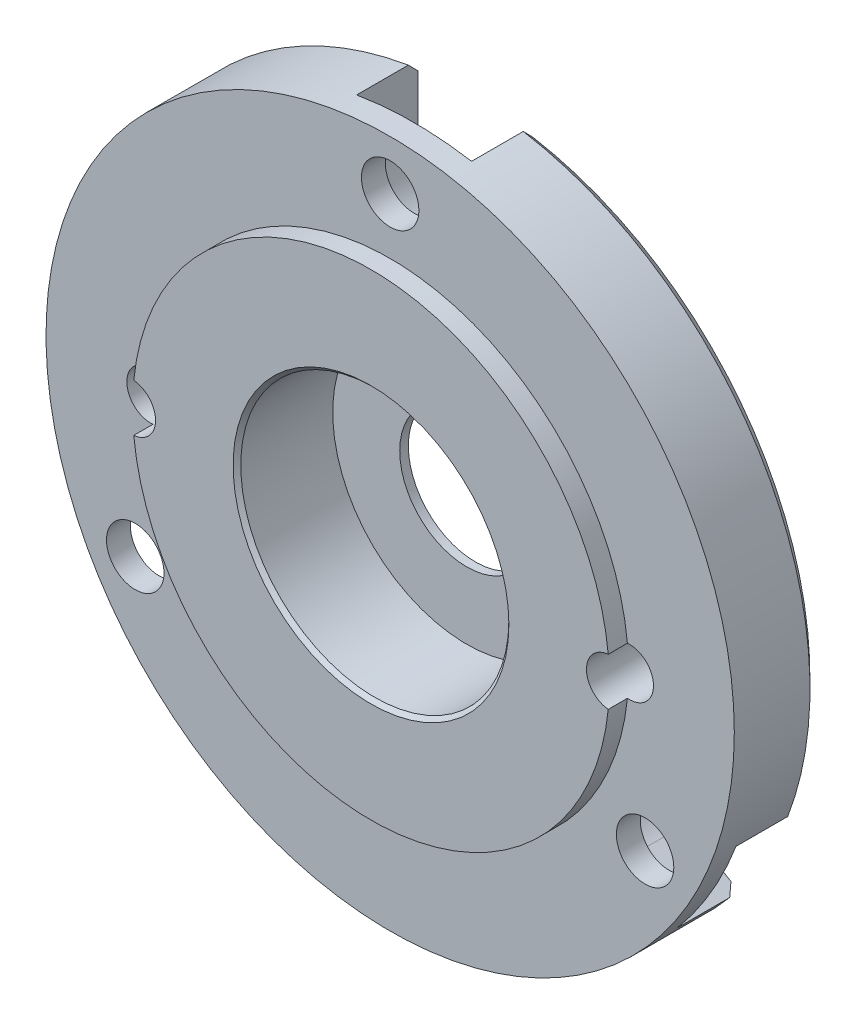
ISO-10303-21;
HEADER;
FILE_DESCRIPTION(('STEP AP214'),'2;1');
FILE_NAME('part.step','',(''),(''),'','','');
FILE_SCHEMA(('AUTOMOTIVE_DESIGN { 1 0 10303 214 1 1 1 1 }'));
ENDSEC;
DATA;
#1=APPLICATION_CONTEXT('core data for automotive mechanical design processes');
#2=APPLICATION_PROTOCOL_DEFINITION('international standard','automotive_design',2000,#1);
#3=PRODUCT_CONTEXT('',#1,'mechanical');
#4=PRODUCT('Part','Part','',(#3));
#5=PRODUCT_RELATED_PRODUCT_CATEGORY('part','',(#4));
#6=PRODUCT_DEFINITION_FORMATION('','',#4);
#7=PRODUCT_DEFINITION_CONTEXT('part definition',#1,'design');
#8=PRODUCT_DEFINITION('design','',#6,#7);
#9=PRODUCT_DEFINITION_SHAPE('','',#8);
#10=(LENGTH_UNIT() NAMED_UNIT(*) SI_UNIT(.MILLI.,.METRE.));
#11=(NAMED_UNIT(*) PLANE_ANGLE_UNIT() SI_UNIT($,.RADIAN.));
#12=(NAMED_UNIT(*) SI_UNIT($,.STERADIAN.) SOLID_ANGLE_UNIT());
#13=UNCERTAINTY_MEASURE_WITH_UNIT(LENGTH_MEASURE(1.E-05),#10,'distance_accuracy_value','');
#14=(GEOMETRIC_REPRESENTATION_CONTEXT(3) GLOBAL_UNCERTAINTY_ASSIGNED_CONTEXT((#13)) GLOBAL_UNIT_ASSIGNED_CONTEXT((#10,
#11,#12)) REPRESENTATION_CONTEXT('',''));
#15=CARTESIAN_POINT('',(0.,0.,0.));
#16=DIRECTION('',(0.,0.,1.));
#17=DIRECTION('',(1.,0.,0.));
#18=AXIS2_PLACEMENT_3D('',#15,#16,#17);
#19=CARTESIAN_POINT('',(-74.8422031977456,51.8720779220779,5.45));
#20=DIRECTION('',(0.,0.,-1.));
#21=DIRECTION('',(-1.,0.,0.));
#22=AXIS2_PLACEMENT_3D('',#19,#20,#21);
#23=CYLINDRICAL_SURFACE('',#22,12.45);
#24=CARTESIAN_POINT('',(-74.8422031977456,51.8720779220779,4.45));
#25=DIRECTION('',(0.,0.,1.));
#26=DIRECTION('',(1.,0.,0.));
#27=AXIS2_PLACEMENT_3D('',#24,#25,#26);
#28=CIRCLE('',#27,12.45);
#29=CARTESIAN_POINT('',(-62.4546031977456,53.1170141614091,4.45));
#30=VERTEX_POINT('',#29);
#31=CARTESIAN_POINT('',(-87.2298031977457,53.1170141614091,4.45));
#32=VERTEX_POINT('',#31);
#33=EDGE_CURVE('E175',#30,#32,#28,.T.);
#34=ORIENTED_EDGE('',*,*,#33,.T.);
#35=DIRECTION('',(0.,0.,-1.));
#36=VECTOR('',#35,1.);
#37=CARTESIAN_POINT('',(-87.2298031977457,53.1170141614091,2.725));
#38=LINE('',#37,#36);
#39=CARTESIAN_POINT('',(-87.2298031977457,53.1170141614091,5.45));
#40=VERTEX_POINT('',#39);
#41=EDGE_CURVE('E163',#32,#40,#38,.F.);
#42=ORIENTED_EDGE('',*,*,#41,.T.);
#43=CARTESIAN_POINT('',(-74.8422031977456,51.8720779220779,5.45));
#44=DIRECTION('',(0.,0.,1.));
#45=DIRECTION('',(1.,0.,0.));
#46=AXIS2_PLACEMENT_3D('',#43,#44,#45);
#47=CIRCLE('',#46,12.45);
#48=CARTESIAN_POINT('',(-62.4546031977456,53.117014161409,5.45));
#49=VERTEX_POINT('',#48);
#50=EDGE_CURVE('E173',#49,#40,#47,.T.);
#51=ORIENTED_EDGE('',*,*,#50,.F.);
#52=DIRECTION('',(0.,0.,-1.));
#53=VECTOR('',#52,1.);
#54=CARTESIAN_POINT('',(-62.4546031977456,53.1170141614091,2.725));
#55=LINE('',#54,#53);
#56=EDGE_CURVE('E54',#49,#30,#55,.T.);
#57=ORIENTED_EDGE('',*,*,#56,.T.);
#58=EDGE_LOOP('',(#34,#42,#51,#57));
#59=FACE_BOUND('',#58,.T.);
#60=ADVANCED_FACE('F32',(#59),#23,.T.);
#61=CARTESIAN_POINT('',(-74.8422031977456,51.8720779220779,0.500000000000004));
#62=DIRECTION('',(0.,0.,1.));
#63=DIRECTION('',(1.,0.,0.));
#64=AXIS2_PLACEMENT_3D('',#61,#62,#63);
#65=CONICAL_SURFACE('',#64,17.97,0.785398163397448);
#66=CARTESIAN_POINT('',(-88.2002208778621,40.6134245524384,-0.000199999999997867));
#67=CARTESIAN_POINT('',(-88.2735733593311,40.5710744775165,0.0831814825688447));
#68=CARTESIAN_POINT('',(-88.3469179438918,40.5287289618768,0.166572223860307));
#69=CARTESIAN_POINT('',(-88.4935913191717,40.444047049176,0.333372223860313));
#70=CARTESIAN_POINT('',(-88.566920109891,40.4017106521149,0.416781482568851));
#71=CARTESIAN_POINT('',(-88.6402410037019,40.359378814336,0.500200000000002));
#72=B_SPLINE_CURVE_WITH_KNOTS('',3,(#66,#67,#68,#69,#70,#71),.UNSPECIFIED.,.F.,.F.,(4,2,4),(0.,
0.356565952680265,0.713131905240145),.UNSPECIFIED.);
#73=CARTESIAN_POINT('',(-88.2003968232458,40.6133229703238,0.));
#74=VERTEX_POINT('',#73);
#75=CARTESIAN_POINT('',(-88.6400652121353,40.3594803076443,0.500000000000008));
#76=VERTEX_POINT('',#75);
#77=EDGE_CURVE('E303',#74,#76,#72,.T.);
#78=ORIENTED_EDGE('',*,*,#77,.F.);
#79=CARTESIAN_POINT('',(-74.8422031977456,51.8720779220779,0.));
#80=DIRECTION('',(0.,0.,1.));
#81=DIRECTION('',(1.,0.,0.));
#82=AXIS2_PLACEMENT_3D('',#79,#80,#81);
#83=CIRCLE('',#82,17.47);
#84=CARTESIAN_POINT('',(-61.4977207946703,40.5970750664679,0.));
#85=VERTEX_POINT('',#84);
#86=EDGE_CURVE('E202',#85,#74,#83,.F.);
#87=ORIENTED_EDGE('',*,*,#86,.F.);
#88=CARTESIAN_POINT('',(-61.0635427554935,40.3361945810799,0.500200000000005));
#89=CARTESIAN_POINT('',(-61.1359218595241,40.3796843343324,0.416784823088143));
#90=CARTESIAN_POINT('',(-61.2083073868908,40.4231779471146,0.333377234636964));
#91=CARTESIAN_POINT('',(-61.3530912883131,40.5101728917485,0.166577234636959));
#92=CARTESIAN_POINT('',(-61.4254896623686,40.5536742236001,0.0831848230881354));
#93=CARTESIAN_POINT('',(-61.4978944597603,40.5971794149814,-0.000200000000000809));
#94=B_SPLINE_CURVE_WITH_KNOTS('',3,(#88,#89,#90,#91,#92,#93),.UNSPECIFIED.,.F.,.F.,(4,2,4),(0.,
0.356080977624851,0.712161955330887),.UNSPECIFIED.);
#95=CARTESIAN_POINT('',(-61.0637162958092,40.3362988546215,0.500000000000004));
#96=VERTEX_POINT('',#95);
#97=EDGE_CURVE('E433',#96,#85,#94,.T.);
#98=ORIENTED_EDGE('',*,*,#97,.F.);
#99=CARTESIAN_POINT('',(-74.8422031977456,51.8720779220779,0.500000000000004));
#100=DIRECTION('',(0.,0.,1.));
#101=DIRECTION('',(1.,0.,0.));
#102=AXIS2_PLACEMENT_3D('',#99,#100,#101);
#103=CIRCLE('',#102,17.97);
#104=EDGE_CURVE('E197',#76,#96,#103,.T.);
#105=ORIENTED_EDGE('',*,*,#104,.F.);
#106=EDGE_LOOP('',(#78,#87,#98,#105));
#107=FACE_BOUND('',#106,.T.);
#108=ADVANCED_FACE('F254',(#107),#65,.T.);
#109=CARTESIAN_POINT('',(-88.1530136539125,44.1870779220779,5.45));
#110=DIRECTION('',(0.,0.,-1.));
#111=DIRECTION('',(-1.,0.,0.));
#112=AXIS2_PLACEMENT_3D('',#109,#110,#111);
#113=CYLINDRICAL_SURFACE('',#112,1.50000000000001);
#114=CARTESIAN_POINT('',(-88.1530136539125,44.1870779220779,4.45));
#115=DIRECTION('',(0.,0.,1.));
#116=DIRECTION('',(1.,0.,0.));
#117=AXIS2_PLACEMENT_3D('',#114,#115,#116);
#118=CIRCLE('',#117,1.50000000000001);
#119=CARTESIAN_POINT('',(-86.6530136539124,44.1870779220779,4.45));
#120=VERTEX_POINT('',#119);
#121=EDGE_CURVE('E324',#120,#120,#118,.T.);
#122=ORIENTED_EDGE('',*,*,#121,.T.);
#123=EDGE_LOOP('',(#122));
#124=FACE_BOUND('',#123,.T.);
#125=CARTESIAN_POINT('',(-88.1530136539125,44.1870779220779,3.2));
#126=DIRECTION('',(0.,0.,-1.));
#127=DIRECTION('',(-1.,0.,0.));
#128=AXIS2_PLACEMENT_3D('',#125,#126,#127);
#129=CIRCLE('',#128,1.50000000000001);
#130=CARTESIAN_POINT('',(-89.6530136539125,44.1870779220779,3.2));
#131=VERTEX_POINT('',#130);
#132=EDGE_CURVE('E362',#131,#131,#129,.F.);
#133=ORIENTED_EDGE('',*,*,#132,.F.);
#134=EDGE_LOOP('',(#133));
#135=FACE_BOUND('',#134,.T.);
#136=ADVANCED_FACE('F250',(#124,#135),#113,.F.);
#137=CARTESIAN_POINT('',(-58.4699334263535,45.7775972573485,-0.000199999999999618));
#138=CARTESIAN_POINT('',(-58.3972269334165,45.7339107889951,0.083179707136008));
#139=CARTESIAN_POINT('',(-58.3245289939025,45.6902294600567,0.166569560712443));
#140=CARTESIAN_POINT('',(-58.1791502217499,45.6028770810276,0.333369560712453));
#141=CARTESIAN_POINT('',(-58.1064693891112,45.5592060309369,0.416779707136019));
#142=CARTESIAN_POINT('',(-58.0337971098956,45.5155401202612,0.500200000000005));
#143=B_SPLINE_CURVE_WITH_KNOTS('',3,(#137,#138,#139,#140,#141,#142),.UNSPECIFIED.,.F.,.F.,(4,2,
4),(0.,0.35682243382694,0.713644867509625),.UNSPECIFIED.);
#144=CARTESIAN_POINT('',(-58.4697590266398,45.7774924674286,0.));
#145=VERTEX_POINT('',#144);
#146=CARTESIAN_POINT('',(-58.0339713427646,45.5156448099307,0.500000000000008));
#147=VERTEX_POINT('',#146);
#148=EDGE_CURVE('E304',#145,#147,#143,.T.);
#149=ORIENTED_EDGE('',*,*,#148,.F.);
#150=CARTESIAN_POINT('',(-71.8422031977456,69.0825660034776,0.));
#151=VERTEX_POINT('',#150);
#152=EDGE_CURVE('E198',#151,#145,#83,.F.);
#153=ORIENTED_EDGE('',*,*,#152,.F.);
#154=CARTESIAN_POINT('',(-71.8422031977456,73.9510229847034,4.81182701392405));
#155=CARTESIAN_POINT('',(-71.8422031977456,73.188762335671,4.05656477941625));
#156=CARTESIAN_POINT('',(-71.8422031977456,72.4262004104416,3.30160534713981));
#157=CARTESIAN_POINT('',(-71.8422031977456,70.9000867576194,1.79269394851582));
#158=CARTESIAN_POINT('',(-71.8422031977456,70.1365350340635,1.0387419780846));
#159=CARTESIAN_POINT('',(-71.8422031977456,68.9901688084127,-0.0911347826652783));
#160=CARTESIAN_POINT('',(-71.8422031977456,68.6078730218659,-0.467585764161266));
#161=CARTESIAN_POINT('',(-71.8422031977456,67.8428519948834,-1.22005090566893));
#162=CARTESIAN_POINT('',(-71.8422031977456,67.4601267545847,-1.59606506581993));
#163=CARTESIAN_POINT('',(-71.8422031977456,66.6941483008052,-2.34755852838192));
#164=CARTESIAN_POINT('',(-71.8422031977456,66.3108950851956,-2.72303782862397));
#165=CARTESIAN_POINT('',(-71.8422031977456,65.5437149731561,-3.4733083304253));
#166=CARTESIAN_POINT('',(-71.8422031977456,65.1597880759751,-3.8480995312165));
#167=CARTESIAN_POINT('',(-71.8422031977456,64.7754511392664,-4.22247040456009));
#168=B_SPLINE_CURVE_WITH_KNOTS('',3,(#154,#155,#156,#157,#158,#159,#160,#161,#162,#163,#164,
#165,#166,#167),.UNSPECIFIED.,.F.,.F.,(4,2,2,2,2,2,4),(0.,3.21918774994048,6.43836241132598,
8.04795482634141,9.65754672784897,11.2671451379849,12.8767453436743),.UNSPECIFIED.);
#169=CARTESIAN_POINT('',(-71.8422031977456,69.5898909925446,0.500000000000004));
#170=VERTEX_POINT('',#169);
#171=EDGE_CURVE('E201',#170,#151,#168,.T.);
#172=ORIENTED_EDGE('',*,*,#171,.F.);
#173=EDGE_CURVE('E185',#147,#170,#103,.T.);
#174=ORIENTED_EDGE('',*,*,#173,.F.);
#175=EDGE_LOOP('',(#149,#153,#172,#174));
#176=FACE_BOUND('',#175,.T.);
#177=ADVANCED_FACE('F253',(#176),#65,.T.);
#178=CARTESIAN_POINT('',(-61.5313927415788,44.187077922078,5.45));
#179=DIRECTION('',(0.,0.,-1.));
#180=DIRECTION('',(-1.,0.,0.));
#181=AXIS2_PLACEMENT_3D('',#178,#179,#180);
#182=CYLINDRICAL_SURFACE('',#181,1.5);
#183=CARTESIAN_POINT('',(-61.5313927415788,44.187077922078,4.45));
#184=DIRECTION('',(0.,0.,1.));
#185=DIRECTION('',(1.,0.,0.));
#186=AXIS2_PLACEMENT_3D('',#183,#184,#185);
#187=CIRCLE('',#186,1.5);
#188=CARTESIAN_POINT('',(-60.0313927415788,44.187077922078,4.45));
#189=VERTEX_POINT('',#188);
#190=EDGE_CURVE('E326',#189,#189,#187,.T.);
#191=ORIENTED_EDGE('',*,*,#190,.T.);
#192=EDGE_LOOP('',(#191));
#193=FACE_BOUND('',#192,.T.);
#194=CARTESIAN_POINT('',(-61.5313927415788,44.187077922078,3.2));
#195=DIRECTION('',(0.,0.,-1.));
#196=DIRECTION('',(-1.,0.,0.));
#197=AXIS2_PLACEMENT_3D('',#194,#195,#196);
#198=CIRCLE('',#197,1.5);
#199=CARTESIAN_POINT('',(-63.0313927415788,44.187077922078,3.2));
#200=VERTEX_POINT('',#199);
#201=EDGE_CURVE('E389',#200,#200,#198,.F.);
#202=ORIENTED_EDGE('',*,*,#201,.F.);
#203=EDGE_LOOP('',(#202));
#204=FACE_BOUND('',#203,.T.);
#205=ADVANCED_FACE('F256',(#193,#204),#182,.F.);
#206=CARTESIAN_POINT('',(-74.8422031977456,67.2420779220779,5.45));
#207=DIRECTION('',(0.,0.,-1.));
#208=DIRECTION('',(-1.,0.,0.));
#209=AXIS2_PLACEMENT_3D('',#206,#207,#208);
#210=CYLINDRICAL_SURFACE('',#209,1.5);
#211=CARTESIAN_POINT('',(-74.8422031977456,67.2420779220779,4.45));
#212=DIRECTION('',(0.,0.,1.));
#213=DIRECTION('',(1.,0.,0.));
#214=AXIS2_PLACEMENT_3D('',#211,#212,#213);
#215=CIRCLE('',#214,1.5);
#216=CARTESIAN_POINT('',(-73.3422031977456,67.2420779220779,4.45));
#217=VERTEX_POINT('',#216);
#218=EDGE_CURVE('E189',#217,#217,#215,.T.);
#219=ORIENTED_EDGE('',*,*,#218,.T.);
#220=EDGE_LOOP('',(#219));
#221=FACE_BOUND('',#220,.T.);
#222=CARTESIAN_POINT('',(-74.8422031977456,67.2420779220779,3.2));
#223=DIRECTION('',(0.,0.,-1.));
#224=DIRECTION('',(-1.,0.,0.));
#225=AXIS2_PLACEMENT_3D('',#222,#223,#224);
#226=CIRCLE('',#225,1.5);
#227=CARTESIAN_POINT('',(-76.3422031977456,67.2420779220779,3.2));
#228=VERTEX_POINT('',#227);
#229=EDGE_CURVE('E208',#228,#228,#226,.F.);
#230=ORIENTED_EDGE('',*,*,#229,.F.);
#231=EDGE_LOOP('',(#230));
#232=FACE_BOUND('',#231,.T.);
#233=ADVANCED_FACE('F248',(#221,#232),#210,.F.);
#234=CARTESIAN_POINT('',(-74.8422031977456,51.8720779220779,5.45));
#235=DIRECTION('',(0.,0.,-1.));
#236=DIRECTION('',(-1.,0.,0.));
#237=AXIS2_PLACEMENT_3D('',#234,#235,#236);
#238=CYLINDRICAL_SURFACE('',#237,3.50000000000001);
#239=CARTESIAN_POINT('',(-74.8422031977456,51.8720779220779,0.));
#240=DIRECTION('',(0.,0.,-1.));
#241=DIRECTION('',(-1.,0.,0.));
#242=AXIS2_PLACEMENT_3D('',#239,#240,#241);
#243=CIRCLE('',#242,3.50000000000001);
#244=CARTESIAN_POINT('',(-78.3422031977456,51.8720779220779,0.));
#245=VERTEX_POINT('',#244);
#246=EDGE_CURVE('E206',#245,#245,#243,.T.);
#247=ORIENTED_EDGE('',*,*,#246,.T.);
#248=EDGE_LOOP('',(#247));
#249=FACE_BOUND('',#248,.T.);
#250=CARTESIAN_POINT('',(-74.8422031977456,51.8720779220779,0.45));
#251=DIRECTION('',(0.,0.,1.));
#252=DIRECTION('',(1.,0.,0.));
#253=AXIS2_PLACEMENT_3D('',#250,#251,#252);
#254=CIRCLE('',#253,3.50000000000001);
#255=CARTESIAN_POINT('',(-71.3422031977456,51.8720779220779,0.45));
#256=VERTEX_POINT('',#255);
#257=EDGE_CURVE('E203',#256,#256,#254,.F.);
#258=ORIENTED_EDGE('',*,*,#257,.F.);
#259=EDGE_LOOP('',(#258));
#260=FACE_BOUND('',#259,.T.);
#261=ADVANCED_FACE('F244',(#249,#260),#238,.F.);
#262=CARTESIAN_POINT('',(-74.8422031977456,51.8720779220779,4.45));
#263=DIRECTION('',(0.,0.,1.));
#264=DIRECTION('',(1.,0.,0.));
#265=AXIS2_PLACEMENT_3D('',#262,#263,#264);
#266=PLANE('',#265);
#267=CARTESIAN_POINT('',(-87.3422031977456,51.8720779220779,4.45));
#268=DIRECTION('',(0.,0.,1.));
#269=DIRECTION('',(1.,0.,0.));
#270=AXIS2_PLACEMENT_3D('',#267,#268,#269);
#271=CIRCLE('',#270,1.25);
#272=CARTESIAN_POINT('',(-87.2298031977457,50.6271416827468,4.45));
#273=VERTEX_POINT('',#272);
#274=EDGE_CURVE('E177',#32,#273,#271,.T.);
#275=ORIENTED_EDGE('',*,*,#274,.F.);
#276=ORIENTED_EDGE('',*,*,#33,.F.);
#277=CARTESIAN_POINT('',(-62.3422031977456,51.8720779220779,4.45));
#278=DIRECTION('',(0.,0.,1.));
#279=DIRECTION('',(1.,0.,0.));
#280=AXIS2_PLACEMENT_3D('',#277,#278,#279);
#281=CIRCLE('',#280,1.24999999999998);
#282=CARTESIAN_POINT('',(-62.4546031977456,50.6271416827468,4.45));
#283=VERTEX_POINT('',#282);
#284=EDGE_CURVE('E337',#283,#30,#281,.T.);
#285=ORIENTED_EDGE('',*,*,#284,.F.);
#286=EDGE_CURVE('E191',#273,#283,#28,.T.);
#287=ORIENTED_EDGE('',*,*,#286,.F.);
#288=EDGE_LOOP('',(#275,#276,#285,#287));
#289=FACE_BOUND('',#288,.T.);
#290=ORIENTED_EDGE('',*,*,#121,.F.);
#291=EDGE_LOOP('',(#290));
#292=FACE_BOUND('',#291,.T.);
#293=ORIENTED_EDGE('',*,*,#190,.F.);
#294=EDGE_LOOP('',(#293));
#295=FACE_BOUND('',#294,.T.);
#296=ORIENTED_EDGE('',*,*,#218,.F.);
#297=EDGE_LOOP('',(#296));
#298=FACE_BOUND('',#297,.T.);
#299=CARTESIAN_POINT('',(-74.8422031977456,51.8720779220779,4.45));
#300=DIRECTION('',(0.,0.,1.));
#301=DIRECTION('',(1.,0.,0.));
#302=AXIS2_PLACEMENT_3D('',#299,#300,#301);
#303=CIRCLE('',#302,17.97);
#304=CARTESIAN_POINT('',(-56.8722031977456,51.8720779220779,4.45));
#305=VERTEX_POINT('',#304);
#306=EDGE_CURVE('E181',#305,#305,#303,.T.);
#307=ORIENTED_EDGE('',*,*,#306,.T.);
#308=EDGE_LOOP('',(#307));
#309=FACE_BOUND('',#308,.T.);
#310=ADVANCED_FACE('F247',(#289,#292,#295,#298,#309),#266,.T.);
#311=CARTESIAN_POINT('',(-74.8422031977456,51.8720779220779,4.45));
#312=DIRECTION('',(0.,0.,-1.));
#313=DIRECTION('',(-1.,0.,0.));
#314=AXIS2_PLACEMENT_3D('',#311,#312,#313);
#315=CYLINDRICAL_SURFACE('',#314,17.97);
#316=CARTESIAN_POINT('',(-74.8422031977456,51.8720779220779,3.2));
#317=DIRECTION('',(0.,0.,-1.));
#318=DIRECTION('',(-1.,0.,0.));
#319=AXIS2_PLACEMENT_3D('',#316,#317,#318);
#320=CIRCLE('',#319,17.97);
#321=CARTESIAN_POINT('',(-88.6400652121353,40.3594803076443,3.2));
#322=VERTEX_POINT('',#321);
#323=CARTESIAN_POINT('',(-91.6609672281103,45.5435649458005,3.2));
#324=VERTEX_POINT('',#323);
#325=EDGE_CURVE('E365',#322,#324,#320,.T.);
#326=ORIENTED_EDGE('',*,*,#325,.F.);
#327=DIRECTION('',(0.,0.,-1.));
#328=VECTOR('',#327,1.);
#329=CARTESIAN_POINT('',(-88.6400652121353,40.3594803076443,4.45));
#330=LINE('',#329,#328);
#331=EDGE_CURVE('E368',#322,#76,#330,.T.);
#332=ORIENTED_EDGE('',*,*,#331,.T.);
#333=ORIENTED_EDGE('',*,*,#104,.T.);
#334=DIRECTION('',(0.,0.,-1.));
#335=VECTOR('',#334,1.);
#336=CARTESIAN_POINT('',(-61.0637162958092,40.3362988546215,4.45));
#337=LINE('',#336,#335);
#338=CARTESIAN_POINT('',(-61.0637162958092,40.3362988546215,3.2));
#339=VERTEX_POINT('',#338);
#340=EDGE_CURVE('E394',#96,#339,#337,.F.);
#341=ORIENTED_EDGE('',*,*,#340,.T.);
#342=CARTESIAN_POINT('',(-74.8422031977456,51.8720779220779,3.2));
#343=DIRECTION('',(0.,0.,-1.));
#344=DIRECTION('',(-1.,0.,0.));
#345=AXIS2_PLACEMENT_3D('',#342,#343,#344);
#346=CIRCLE('',#345,17.97);
#347=CARTESIAN_POINT('',(-58.0339713427646,45.5156448099307,3.2));
#348=VERTEX_POINT('',#347);
#349=EDGE_CURVE('E392',#348,#339,#346,.T.);
#350=ORIENTED_EDGE('',*,*,#349,.F.);
#351=DIRECTION('',(0.,0.,-1.));
#352=VECTOR('',#351,1.);
#353=CARTESIAN_POINT('',(-58.0339713427646,45.5156448099307,4.45));
#354=LINE('',#353,#352);
#355=EDGE_CURVE('E397',#348,#147,#354,.T.);
#356=ORIENTED_EDGE('',*,*,#355,.T.);
#357=ORIENTED_EDGE('',*,*,#173,.T.);
#358=DIRECTION('',(0.,0.,-1.));
#359=VECTOR('',#358,1.);
#360=CARTESIAN_POINT('',(-71.8422031977456,69.5898909925446,4.45));
#361=LINE('',#360,#359);
#362=CARTESIAN_POINT('',(-71.8422031977456,69.5898909925446,3.2));
#363=VERTEX_POINT('',#362);
#364=EDGE_CURVE('E315',#170,#363,#361,.F.);
#365=ORIENTED_EDGE('',*,*,#364,.T.);
#366=CARTESIAN_POINT('',(-74.8422031977456,51.8720779220779,3.2));
#367=DIRECTION('',(0.,0.,-1.));
#368=DIRECTION('',(-1.,0.,0.));
#369=AXIS2_PLACEMENT_3D('',#366,#367,#368);
#370=CIRCLE('',#369,17.97);
#371=CARTESIAN_POINT('',(-77.8422031977456,69.5898909925446,3.2));
#372=VERTEX_POINT('',#371);
#373=EDGE_CURVE('E211',#372,#363,#370,.T.);
#374=ORIENTED_EDGE('',*,*,#373,.F.);
#375=DIRECTION('',(0.,0.,-1.));
#376=VECTOR('',#375,1.);
#377=CARTESIAN_POINT('',(-77.8422031977456,69.5898909925446,4.45));
#378=LINE('',#377,#376);
#379=CARTESIAN_POINT('',(-77.8422031977456,69.5898909925446,0.500000000000008));
#380=VERTEX_POINT('',#379);
#381=EDGE_CURVE('E310',#372,#380,#378,.T.);
#382=ORIENTED_EDGE('',*,*,#381,.T.);
#383=CARTESIAN_POINT('',(-91.6609672281103,45.5435649458005,0.500000000000004));
#384=VERTEX_POINT('',#383);
#385=EDGE_CURVE('E193',#380,#384,#103,.T.);
#386=ORIENTED_EDGE('',*,*,#385,.T.);
#387=DIRECTION('',(0.,0.,-1.));
#388=VECTOR('',#387,1.);
#389=CARTESIAN_POINT('',(-91.6609672281103,45.5435649458005,4.45));
#390=LINE('',#389,#388);
#391=EDGE_CURVE('E308',#384,#324,#390,.F.);
#392=ORIENTED_EDGE('',*,*,#391,.T.);
#393=EDGE_LOOP('',(#326,#332,#333,#341,#350,#356,#357,#365,#374,#382,#386,#392));
#394=FACE_BOUND('',#393,.T.);
#395=ORIENTED_EDGE('',*,*,#306,.F.);
#396=EDGE_LOOP('',(#395));
#397=FACE_BOUND('',#396,.T.);
#398=ADVANCED_FACE('F272',(#394,#397),#315,.T.);
#399=CARTESIAN_POINT('',(-74.8422031977456,51.8720779220779,0.));
#400=DIRECTION('',(0.,0.,1.));
#401=DIRECTION('',(1.,0.,0.));
#402=AXIS2_PLACEMENT_3D('',#399,#400,#401);
#403=PLANE('',#402);
#404=CARTESIAN_POINT('',(-87.3422031977456,51.8720779220779,0.));
#405=DIRECTION('',(0.,0.,-1.));
#406=DIRECTION('',(-1.,0.,0.));
#407=AXIS2_PLACEMENT_3D('',#404,#405,#406);
#408=CIRCLE('',#407,1.25);
#409=CARTESIAN_POINT('',(-88.5922031977456,51.8720779220779,0.));
#410=VERTEX_POINT('',#409);
#411=EDGE_CURVE('E168',#410,#410,#408,.T.);
#412=ORIENTED_EDGE('',*,*,#411,.F.);
#413=EDGE_LOOP('',(#412));
#414=FACE_BOUND('',#413,.T.);
#415=CARTESIAN_POINT('',(-62.3422031977456,51.8720779220779,0.));
#416=DIRECTION('',(0.,0.,-1.));
#417=DIRECTION('',(-1.,0.,0.));
#418=AXIS2_PLACEMENT_3D('',#415,#416,#417);
#419=CIRCLE('',#418,1.24999999999998);
#420=CARTESIAN_POINT('',(-63.5922031977456,51.8720779220779,0.));
#421=VERTEX_POINT('',#420);
#422=EDGE_CURVE('E176',#421,#421,#419,.T.);
#423=ORIENTED_EDGE('',*,*,#422,.F.);
#424=EDGE_LOOP('',(#423));
#425=FACE_BOUND('',#424,.T.);
#426=ORIENTED_EDGE('',*,*,#246,.F.);
#427=EDGE_LOOP('',(#426));
#428=FACE_BOUND('',#427,.T.);
#429=ORIENTED_EDGE('',*,*,#86,.T.);
#430=DIRECTION('',(-0.86602540378444,-0.499999999999998,0.));
#431=VECTOR('',#430,1.);
#432=CARTESIAN_POINT('',(-89.3713389427206,39.9372792224396,0.));
#433=LINE('',#432,#431);
#434=CARTESIAN_POINT('',(-85.8654510915531,41.9614045170597,0.));
#435=VERTEX_POINT('',#434);
#436=EDGE_CURVE('E348',#435,#74,#433,.T.);
#437=ORIENTED_EDGE('',*,*,#436,.F.);
#438=CARTESIAN_POINT('',(-87.365451091553,44.5594807284128,0.));
#439=DIRECTION('',(0.,0.,-1.));
#440=DIRECTION('',(-1.,0.,0.));
#441=AXIS2_PLACEMENT_3D('',#438,#439,#440);
#442=CIRCLE('',#441,2.99999999999972);
#443=CARTESIAN_POINT('',(-88.8654510915528,47.1575569397659,0.));
#444=VERTEX_POINT('',#443);
#445=EDGE_CURVE('E356',#444,#435,#442,.T.);
#446=ORIENTED_EDGE('',*,*,#445,.F.);
#447=DIRECTION('',(0.866025403784438,0.5,0.));
#448=VECTOR('',#447,1.);
#449=CARTESIAN_POINT('',(-92.3713389427203,45.1334316451457,0.));
#450=LINE('',#449,#448);
#451=CARTESIAN_POINT('',(-91.2219149928599,45.7970518720106,0.));
#452=VERTEX_POINT('',#451);
#453=EDGE_CURVE('E338',#452,#444,#450,.T.);
#454=ORIENTED_EDGE('',*,*,#453,.F.);
#455=CARTESIAN_POINT('',(-77.8422031977456,69.0825660034776,0.));
#456=VERTEX_POINT('',#455);
#457=EDGE_CURVE('E196',#452,#456,#83,.F.);
#458=ORIENTED_EDGE('',*,*,#457,.T.);
#459=DIRECTION('',(0.,1.,0.));
#460=VECTOR('',#459,1.);
#461=CARTESIAN_POINT('',(-77.8422031977456,70.4119051335084,0.));
#462=LINE('',#461,#460);
#463=CARTESIAN_POINT('',(-77.8422031977456,66.3636545442682,0.));
#464=VERTEX_POINT('',#463);
#465=EDGE_CURVE('E404',#464,#456,#462,.T.);
#466=ORIENTED_EDGE('',*,*,#465,.F.);
#467=CARTESIAN_POINT('',(-74.8422031977456,66.3636545442682,0.));
#468=DIRECTION('',(0.,0.,-1.));
#469=DIRECTION('',(-1.,0.,0.));
#470=AXIS2_PLACEMENT_3D('',#467,#468,#469);
#471=CIRCLE('',#470,3.);
#472=CARTESIAN_POINT('',(-71.8422031977456,66.3636545442682,0.));
#473=VERTEX_POINT('',#472);
#474=EDGE_CURVE('E411',#473,#464,#471,.T.);
#475=ORIENTED_EDGE('',*,*,#474,.F.);
#476=DIRECTION('',(0.,-1.,0.));
#477=VECTOR('',#476,1.);
#478=CARTESIAN_POINT('',(-71.8422031977456,70.4119051335084,0.));
#479=LINE('',#478,#477);
#480=EDGE_CURVE('E400',#151,#473,#479,.T.);
#481=ORIENTED_EDGE('',*,*,#480,.F.);
#482=ORIENTED_EDGE('',*,*,#152,.T.);
#483=DIRECTION('',(0.857167300702106,-0.515038074910064,0.));
#484=VECTOR('',#483,1.);
#485=CARTESIAN_POINT('',(-57.2893259383132,45.0682167112561,0.));
#486=LINE('',#485,#484);
#487=CARTESIAN_POINT('',(-60.759353968458,47.1532199014919,0.));
#488=VERTEX_POINT('',#487);
#489=EDGE_CURVE('E375',#488,#145,#486,.T.);
#490=ORIENTED_EDGE('',*,*,#489,.F.);
#491=CARTESIAN_POINT('',(-62.304468193188,44.5817179993859,0.));
#492=DIRECTION('',(0.,0.,-1.));
#493=DIRECTION('',(-1.,0.,0.));
#494=AXIS2_PLACEMENT_3D('',#491,#492,#493);
#495=CIRCLE('',#494,2.99999999999965);
#496=CARTESIAN_POINT('',(-63.8495824179181,42.0102160972799,0.));
#497=VERTEX_POINT('',#496);
#498=EDGE_CURVE('E383',#497,#488,#495,.T.);
#499=ORIENTED_EDGE('',*,*,#498,.F.);
#500=DIRECTION('',(-0.857167300702095,0.515038074910083,0.));
#501=VECTOR('',#500,1.);
#502=CARTESIAN_POINT('',(-60.3795543877733,39.9252129070439,0.));
#503=LINE('',#502,#501);
#504=EDGE_CURVE('E371',#85,#497,#503,.T.);
#505=ORIENTED_EDGE('',*,*,#504,.F.);
#506=EDGE_LOOP('',(#429,#437,#446,#454,#458,#466,#475,#481,#482,#490,#499,#505));
#507=FACE_BOUND('',#506,.T.);
#508=ADVANCED_FACE('F268',(#414,#425,#428,#507),#403,.F.);
#509=CARTESIAN_POINT('',(-87.2298031977457,50.6271416827468,5.45));
#510=VERTEX_POINT('',#509);
#511=CARTESIAN_POINT('',(-62.4546031977456,50.6271416827468,5.45));
#512=VERTEX_POINT('',#511);
#513=EDGE_CURVE('E182',#510,#512,#47,.T.);
#514=ORIENTED_EDGE('',*,*,#513,.F.);
#515=DIRECTION('',(0.,0.,-1.));
#516=VECTOR('',#515,1.);
#517=CARTESIAN_POINT('',(-87.2298031977457,50.6271416827468,2.725));
#518=LINE('',#517,#516);
#519=EDGE_CURVE('E47',#510,#273,#518,.T.);
#520=ORIENTED_EDGE('',*,*,#519,.T.);
#521=ORIENTED_EDGE('',*,*,#286,.T.);
#522=DIRECTION('',(0.,0.,-1.));
#523=VECTOR('',#522,1.);
#524=CARTESIAN_POINT('',(-62.4546031977456,50.6271416827468,2.725));
#525=LINE('',#524,#523);
#526=EDGE_CURVE('E334',#283,#512,#525,.F.);
#527=ORIENTED_EDGE('',*,*,#526,.T.);
#528=EDGE_LOOP('',(#514,#520,#521,#527));
#529=FACE_BOUND('',#528,.T.);
#530=ADVANCED_FACE('F265',(#529),#23,.T.);
#531=CARTESIAN_POINT('',(-74.8422031977456,51.8720779220779,5.45));
#532=DIRECTION('',(0.,0.,1.));
#533=DIRECTION('',(1.,0.,0.));
#534=AXIS2_PLACEMENT_3D('',#531,#532,#533);
#535=PLANE('',#534);
#536=CARTESIAN_POINT('',(-87.3422031977456,51.8720779220779,5.45));
#537=DIRECTION('',(0.,0.,-1.));
#538=DIRECTION('',(-1.,0.,0.));
#539=AXIS2_PLACEMENT_3D('',#536,#537,#538);
#540=CIRCLE('',#539,1.25);
#541=EDGE_CURVE('E160',#40,#510,#540,.T.);
#542=ORIENTED_EDGE('',*,*,#541,.T.);
#543=ORIENTED_EDGE('',*,*,#513,.T.);
#544=CARTESIAN_POINT('',(-62.3422031977456,51.8720779220779,5.45));
#545=DIRECTION('',(0.,0.,1.));
#546=DIRECTION('',(1.,0.,0.));
#547=AXIS2_PLACEMENT_3D('',#544,#545,#546);
#548=CIRCLE('',#547,1.24999999999998);
#549=EDGE_CURVE('E11',#49,#512,#548,.T.);
#550=ORIENTED_EDGE('',*,*,#549,.F.);
#551=ORIENTED_EDGE('',*,*,#50,.T.);
#552=EDGE_LOOP('',(#542,#543,#550,#551));
#553=FACE_BOUND('',#552,.T.);
#554=CARTESIAN_POINT('',(-74.8422031977456,51.8720779220779,5.45));
#555=DIRECTION('',(0.,0.,1.));
#556=DIRECTION('',(1.,0.,0.));
#557=AXIS2_PLACEMENT_3D('',#554,#555,#556);
#558=CIRCLE('',#557,7.20000000000001);
#559=CARTESIAN_POINT('',(-67.6422031977456,51.8720779220779,5.45));
#560=VERTEX_POINT('',#559);
#561=EDGE_CURVE('E40',#560,#560,#558,.F.);
#562=ORIENTED_EDGE('',*,*,#561,.T.);
#563=EDGE_LOOP('',(#562));
#564=FACE_BOUND('',#563,.T.);
#565=ADVANCED_FACE('F179',(#553,#564),#535,.T.);
#566=CARTESIAN_POINT('',(-91.6611427803738,45.5434635906539,0.500200000000002));
#567=CARTESIAN_POINT('',(-91.5879231890765,45.5857369413993,0.416783231881546));
#568=CARTESIAN_POINT('',(-91.5146964368445,45.6280144265123,0.333374847828105));
#569=CARTESIAN_POINT('',(-91.368228610491,45.7125776654851,0.166574847828097));
#570=CARTESIAN_POINT('',(-91.2949875363695,45.754863419345,0.0831832318815355));
#571=CARTESIAN_POINT('',(-91.2217393013132,45.7971533075724,-0.000200000000007814));
#572=B_SPLINE_CURVE_WITH_KNOTS('',3,(#566,#567,#568,#569,#570,#571),.UNSPECIFIED.,.F.,.F.,(4,2,
4),(0.,0.356312382163325,0.712624764425558),.UNSPECIFIED.);
#573=EDGE_CURVE('E299',#384,#452,#572,.T.);
#574=ORIENTED_EDGE('',*,*,#573,.F.);
#575=ORIENTED_EDGE('',*,*,#385,.F.);
#576=CARTESIAN_POINT('',(-77.8422031977456,64.7754511392664,-4.22247040456009));
#577=CARTESIAN_POINT('',(-77.8422031977456,65.1597880759751,-3.84809953121651));
#578=CARTESIAN_POINT('',(-77.8422031977456,65.5437149731561,-3.47330833042531));
#579=CARTESIAN_POINT('',(-77.8422031977456,66.3108950851956,-2.72303782862398));
#580=CARTESIAN_POINT('',(-77.8422031977456,66.6941483008051,-2.34755852838192));
#581=CARTESIAN_POINT('',(-77.8422031977456,67.4601267545847,-1.59606506581993));
#582=CARTESIAN_POINT('',(-77.8422031977456,67.8428519948834,-1.22005090566894));
#583=CARTESIAN_POINT('',(-77.8422031977456,68.6078730218659,-0.467585764161275));
#584=CARTESIAN_POINT('',(-77.8422031977456,68.9901688084127,-0.0911347826652836));
#585=CARTESIAN_POINT('',(-77.8422031977456,70.1365350340635,1.0387419780846));
#586=CARTESIAN_POINT('',(-77.8422031977456,70.9000867576194,1.79269394851582));
#587=CARTESIAN_POINT('',(-77.8422031977456,72.4262004104416,3.30160534713981));
#588=CARTESIAN_POINT('',(-77.8422031977456,73.188762335671,4.05656477941625));
#589=CARTESIAN_POINT('',(-77.8422031977456,73.9510229847034,4.81182701392405));
#590=B_SPLINE_CURVE_WITH_KNOTS('',3,(#576,#577,#578,#579,#580,#581,#582,#583,#584,#585,#586,
#587,#588,#589),.UNSPECIFIED.,.F.,.F.,(4,2,2,2,2,2,4),(0.,1.60960020568941,3.21919861582532,
4.82879051733288,6.43838293234831,9.65755759373382,12.8767453436743),.UNSPECIFIED.);
#591=EDGE_CURVE('E218',#456,#380,#590,.T.);
#592=ORIENTED_EDGE('',*,*,#591,.F.);
#593=ORIENTED_EDGE('',*,*,#457,.F.);
#594=EDGE_LOOP('',(#574,#575,#592,#593));
#595=FACE_BOUND('',#594,.T.);
#596=ADVANCED_FACE('F224',(#595),#65,.T.);
#597=CARTESIAN_POINT('',(-74.8422031977456,51.8720779220779,0.45));
#598=DIRECTION('',(0.,0.,1.));
#599=DIRECTION('',(1.,0.,0.));
#600=AXIS2_PLACEMENT_3D('',#597,#598,#599);
#601=PLANE('',#600);
#602=CARTESIAN_POINT('',(-74.8422031977456,51.8720779220779,0.45));
#603=DIRECTION('',(0.,0.,1.));
#604=DIRECTION('',(1.,0.,0.));
#605=AXIS2_PLACEMENT_3D('',#602,#603,#604);
#606=CIRCLE('',#605,7.);
#607=CARTESIAN_POINT('',(-67.8422031977456,51.8720779220779,0.45));
#608=VERTEX_POINT('',#607);
#609=EDGE_CURVE('E207',#608,#608,#606,.T.);
#610=ORIENTED_EDGE('',*,*,#609,.T.);
#611=EDGE_LOOP('',(#610));
#612=FACE_BOUND('',#611,.T.);
#613=ORIENTED_EDGE('',*,*,#257,.T.);
#614=EDGE_LOOP('',(#613));
#615=FACE_BOUND('',#614,.T.);
#616=ADVANCED_FACE('F236',(#612,#615),#601,.T.);
#617=CARTESIAN_POINT('',(-74.8422031977456,51.8720779220779,0.45));
#618=DIRECTION('',(0.,0.,1.));
#619=DIRECTION('',(1.,0.,0.));
#620=AXIS2_PLACEMENT_3D('',#617,#618,#619);
#621=CYLINDRICAL_SURFACE('',#620,7.);
#622=CARTESIAN_POINT('',(-74.8422031977456,51.8720779220779,5.24999999999998));
#623=DIRECTION('',(0.,0.,1.));
#624=DIRECTION('',(1.,0.,0.));
#625=AXIS2_PLACEMENT_3D('',#622,#623,#624);
#626=CIRCLE('',#625,7.);
#627=CARTESIAN_POINT('',(-67.8422031977456,51.8720779220779,5.24999999999998));
#628=VERTEX_POINT('',#627);
#629=EDGE_CURVE('E502',#628,#628,#626,.T.);
#630=ORIENTED_EDGE('',*,*,#629,.T.);
#631=EDGE_LOOP('',(#630));
#632=FACE_BOUND('',#631,.T.);
#633=ORIENTED_EDGE('',*,*,#609,.F.);
#634=EDGE_LOOP('',(#633));
#635=FACE_BOUND('',#634,.T.);
#636=ADVANCED_FACE('F239',(#632,#635),#621,.F.);
#637=CARTESIAN_POINT('',(-77.8422031977456,70.4119051335084,3.2));
#638=DIRECTION('',(-1.,0.,0.));
#639=DIRECTION('',(0.,0.,1.));
#640=AXIS2_PLACEMENT_3D('',#637,#638,#639);
#641=PLANE('',#640);
#642=DIRECTION('',(0.,1.,0.));
#643=VECTOR('',#642,1.);
#644=CARTESIAN_POINT('',(-77.8422031977456,70.4119051335084,3.2));
#645=LINE('',#644,#643);
#646=CARTESIAN_POINT('',(-77.8422031977456,66.3636545442682,3.2));
#647=VERTEX_POINT('',#646);
#648=EDGE_CURVE('E407',#647,#372,#645,.T.);
#649=ORIENTED_EDGE('',*,*,#648,.F.);
#650=DIRECTION('',(0.,0.,-1.));
#651=VECTOR('',#650,1.);
#652=CARTESIAN_POINT('',(-77.8422031977456,66.3636545442682,3.2));
#653=LINE('',#652,#651);
#654=EDGE_CURVE('E212',#647,#464,#653,.T.);
#655=ORIENTED_EDGE('',*,*,#654,.T.);
#656=ORIENTED_EDGE('',*,*,#465,.T.);
#657=ORIENTED_EDGE('',*,*,#591,.T.);
#658=ORIENTED_EDGE('',*,*,#381,.F.);
#659=EDGE_LOOP('',(#649,#655,#656,#657,#658));
#660=FACE_BOUND('',#659,.T.);
#661=ADVANCED_FACE('F233',(#660),#641,.F.);
#662=CARTESIAN_POINT('',(-71.8422031977456,70.4119051335084,3.2));
#663=DIRECTION('',(1.,0.,0.));
#664=DIRECTION('',(0.,0.,-1.));
#665=AXIS2_PLACEMENT_3D('',#662,#663,#664);
#666=PLANE('',#665);
#667=ORIENTED_EDGE('',*,*,#171,.T.);
#668=ORIENTED_EDGE('',*,*,#480,.T.);
#669=DIRECTION('',(0.,0.,-1.));
#670=VECTOR('',#669,1.);
#671=CARTESIAN_POINT('',(-71.8422031977456,66.3636545442682,3.2));
#672=LINE('',#671,#670);
#673=CARTESIAN_POINT('',(-71.8422031977456,66.3636545442682,3.2));
#674=VERTEX_POINT('',#673);
#675=EDGE_CURVE('E409',#674,#473,#672,.T.);
#676=ORIENTED_EDGE('',*,*,#675,.F.);
#677=DIRECTION('',(0.,-1.,0.));
#678=VECTOR('',#677,1.);
#679=CARTESIAN_POINT('',(-71.8422031977456,70.4119051335084,3.2));
#680=LINE('',#679,#678);
#681=EDGE_CURVE('E401',#363,#674,#680,.T.);
#682=ORIENTED_EDGE('',*,*,#681,.F.);
#683=ORIENTED_EDGE('',*,*,#364,.F.);
#684=EDGE_LOOP('',(#667,#668,#676,#682,#683));
#685=FACE_BOUND('',#684,.T.);
#686=ADVANCED_FACE('F227',(#685),#666,.F.);
#687=CARTESIAN_POINT('',(-74.8422031977456,66.3636545442682,3.2));
#688=DIRECTION('',(0.,0.,-1.));
#689=DIRECTION('',(-1.,0.,0.));
#690=AXIS2_PLACEMENT_3D('',#687,#688,#689);
#691=PLANE('',#690);
#692=ORIENTED_EDGE('',*,*,#229,.T.);
#693=EDGE_LOOP('',(#692));
#694=FACE_BOUND('',#693,.T.);
#695=ORIENTED_EDGE('',*,*,#373,.T.);
#696=ORIENTED_EDGE('',*,*,#681,.T.);
#697=CARTESIAN_POINT('',(-74.8422031977456,66.3636545442682,3.2));
#698=DIRECTION('',(0.,0.,-1.));
#699=DIRECTION('',(-1.,0.,0.));
#700=AXIS2_PLACEMENT_3D('',#697,#698,#699);
#701=CIRCLE('',#700,3.);
#702=EDGE_CURVE('E403',#674,#647,#701,.T.);
#703=ORIENTED_EDGE('',*,*,#702,.T.);
#704=ORIENTED_EDGE('',*,*,#648,.T.);
#705=EDGE_LOOP('',(#695,#696,#703,#704));
#706=FACE_BOUND('',#705,.T.);
#707=ADVANCED_FACE('F232',(#694,#706),#691,.T.);
#708=CARTESIAN_POINT('',(-74.8422031977456,66.3636545442682,3.2));
#709=DIRECTION('',(0.,0.,-1.));
#710=DIRECTION('',(-1.,0.,0.));
#711=AXIS2_PLACEMENT_3D('',#708,#709,#710);
#712=CYLINDRICAL_SURFACE('',#711,3.);
#713=ORIENTED_EDGE('',*,*,#474,.T.);
#714=ORIENTED_EDGE('',*,*,#654,.F.);
#715=ORIENTED_EDGE('',*,*,#702,.F.);
#716=ORIENTED_EDGE('',*,*,#675,.T.);
#717=EDGE_LOOP('',(#713,#714,#715,#716));
#718=FACE_BOUND('',#717,.T.);
#719=ADVANCED_FACE('F235',(#718),#712,.F.);
#720=CARTESIAN_POINT('',(-57.2893259383132,45.0682167112561,3.2));
#721=DIRECTION('',(0.515038074910064,0.857167300702106,0.));
#722=DIRECTION('',(-0.857167300702107,0.515038074910064,0.));
#723=AXIS2_PLACEMENT_3D('',#720,#721,#722);
#724=PLANE('',#723);
#725=DIRECTION('',(0.857167300702106,-0.515038074910064,0.));
#726=VECTOR('',#725,1.);
#727=CARTESIAN_POINT('',(-57.2893259383132,45.0682167112561,3.2));
#728=LINE('',#727,#726);
#729=CARTESIAN_POINT('',(-60.759353968458,47.1532199014919,3.2));
#730=VERTEX_POINT('',#729);
#731=EDGE_CURVE('E378',#730,#348,#728,.T.);
#732=ORIENTED_EDGE('',*,*,#731,.F.);
#733=DIRECTION('',(0.,0.,-1.));
#734=VECTOR('',#733,1.);
#735=CARTESIAN_POINT('',(-60.759353968458,47.1532199014919,3.2));
#736=LINE('',#735,#734);
#737=EDGE_CURVE('E387',#730,#488,#736,.T.);
#738=ORIENTED_EDGE('',*,*,#737,.T.);
#739=ORIENTED_EDGE('',*,*,#489,.T.);
#740=ORIENTED_EDGE('',*,*,#148,.T.);
#741=ORIENTED_EDGE('',*,*,#355,.F.);
#742=EDGE_LOOP('',(#732,#738,#739,#740,#741));
#743=FACE_BOUND('',#742,.T.);
#744=ADVANCED_FACE('F454',(#743),#724,.F.);
#745=CARTESIAN_POINT('',(-60.3795543877733,39.9252129070439,3.2));
#746=DIRECTION('',(-0.515038074910083,-0.857167300702095,0.));
#747=DIRECTION('',(0.857167300702095,-0.515038074910083,0.));
#748=AXIS2_PLACEMENT_3D('',#745,#746,#747);
#749=PLANE('',#748);
#750=ORIENTED_EDGE('',*,*,#97,.T.);
#751=ORIENTED_EDGE('',*,*,#504,.T.);
#752=DIRECTION('',(0.,0.,-1.));
#753=VECTOR('',#752,1.);
#754=CARTESIAN_POINT('',(-63.8495824179181,42.0102160972799,3.2));
#755=LINE('',#754,#753);
#756=CARTESIAN_POINT('',(-63.8495824179181,42.0102160972799,3.2));
#757=VERTEX_POINT('',#756);
#758=EDGE_CURVE('E381',#757,#497,#755,.T.);
#759=ORIENTED_EDGE('',*,*,#758,.F.);
#760=DIRECTION('',(-0.857167300702095,0.515038074910083,0.));
#761=VECTOR('',#760,1.);
#762=CARTESIAN_POINT('',(-60.3795543877733,39.9252129070439,3.2));
#763=LINE('',#762,#761);
#764=EDGE_CURVE('E372',#339,#757,#763,.T.);
#765=ORIENTED_EDGE('',*,*,#764,.F.);
#766=ORIENTED_EDGE('',*,*,#340,.F.);
#767=EDGE_LOOP('',(#750,#751,#759,#765,#766));
#768=FACE_BOUND('',#767,.T.);
#769=ADVANCED_FACE('F432',(#768),#749,.F.);
#770=CARTESIAN_POINT('',(-62.304468193188,44.5817179993859,3.2));
#771=DIRECTION('',(0.,0.,-1.));
#772=DIRECTION('',(-1.,0.,0.));
#773=AXIS2_PLACEMENT_3D('',#770,#771,#772);
#774=PLANE('',#773);
#775=ORIENTED_EDGE('',*,*,#201,.T.);
#776=EDGE_LOOP('',(#775));
#777=FACE_BOUND('',#776,.T.);
#778=ORIENTED_EDGE('',*,*,#349,.T.);
#779=ORIENTED_EDGE('',*,*,#764,.T.);
#780=CARTESIAN_POINT('',(-62.304468193188,44.5817179993859,3.2));
#781=DIRECTION('',(0.,0.,-1.));
#782=DIRECTION('',(-1.,0.,0.));
#783=AXIS2_PLACEMENT_3D('',#780,#781,#782);
#784=CIRCLE('',#783,2.99999999999965);
#785=EDGE_CURVE('E374',#757,#730,#784,.T.);
#786=ORIENTED_EDGE('',*,*,#785,.T.);
#787=ORIENTED_EDGE('',*,*,#731,.T.);
#788=EDGE_LOOP('',(#778,#779,#786,#787));
#789=FACE_BOUND('',#788,.T.);
#790=ADVANCED_FACE('F453',(#777,#789),#774,.T.);
#791=CARTESIAN_POINT('',(-62.304468193188,44.5817179993859,3.2));
#792=DIRECTION('',(0.,0.,-1.));
#793=DIRECTION('',(-1.,0.,0.));
#794=AXIS2_PLACEMENT_3D('',#791,#792,#793);
#795=CYLINDRICAL_SURFACE('',#794,2.99999999999965);
#796=ORIENTED_EDGE('',*,*,#498,.T.);
#797=ORIENTED_EDGE('',*,*,#737,.F.);
#798=ORIENTED_EDGE('',*,*,#785,.F.);
#799=ORIENTED_EDGE('',*,*,#758,.T.);
#800=EDGE_LOOP('',(#796,#797,#798,#799));
#801=FACE_BOUND('',#800,.T.);
#802=ADVANCED_FACE('F455',(#801),#795,.F.);
#803=CARTESIAN_POINT('',(-89.3713389427206,39.9372792224396,3.2));
#804=DIRECTION('',(0.499999999999998,-0.86602540378444,0.));
#805=DIRECTION('',(0.86602540378444,0.499999999999998,0.));
#806=AXIS2_PLACEMENT_3D('',#803,#804,#805);
#807=PLANE('',#806);
#808=DIRECTION('',(-0.86602540378444,-0.499999999999998,0.));
#809=VECTOR('',#808,1.);
#810=CARTESIAN_POINT('',(-89.3713389427206,39.9372792224396,3.2));
#811=LINE('',#810,#809);
#812=CARTESIAN_POINT('',(-85.8654510915531,41.9614045170597,3.2));
#813=VERTEX_POINT('',#812);
#814=EDGE_CURVE('E351',#813,#322,#811,.T.);
#815=ORIENTED_EDGE('',*,*,#814,.F.);
#816=DIRECTION('',(0.,0.,-1.));
#817=VECTOR('',#816,1.);
#818=CARTESIAN_POINT('',(-85.8654510915531,41.9614045170597,3.2));
#819=LINE('',#818,#817);
#820=EDGE_CURVE('E360',#813,#435,#819,.T.);
#821=ORIENTED_EDGE('',*,*,#820,.T.);
#822=ORIENTED_EDGE('',*,*,#436,.T.);
#823=ORIENTED_EDGE('',*,*,#77,.T.);
#824=ORIENTED_EDGE('',*,*,#331,.F.);
#825=EDGE_LOOP('',(#815,#821,#822,#823,#824));
#826=FACE_BOUND('',#825,.T.);
#827=ADVANCED_FACE('F491',(#826),#807,.F.);
#828=CARTESIAN_POINT('',(-92.3713389427203,45.1334316451457,3.2));
#829=DIRECTION('',(-0.5,0.866025403784438,0.));
#830=DIRECTION('',(-0.866025403784438,-0.5,0.));
#831=AXIS2_PLACEMENT_3D('',#828,#829,#830);
#832=PLANE('',#831);
#833=ORIENTED_EDGE('',*,*,#573,.T.);
#834=ORIENTED_EDGE('',*,*,#453,.T.);
#835=DIRECTION('',(0.,0.,-1.));
#836=VECTOR('',#835,1.);
#837=CARTESIAN_POINT('',(-88.8654510915528,47.1575569397659,3.2));
#838=LINE('',#837,#836);
#839=CARTESIAN_POINT('',(-88.8654510915528,47.1575569397659,3.2));
#840=VERTEX_POINT('',#839);
#841=EDGE_CURVE('E354',#840,#444,#838,.T.);
#842=ORIENTED_EDGE('',*,*,#841,.F.);
#843=DIRECTION('',(0.866025403784438,0.5,0.));
#844=VECTOR('',#843,1.);
#845=CARTESIAN_POINT('',(-92.3713389427203,45.1334316451457,3.2));
#846=LINE('',#845,#844);
#847=EDGE_CURVE('E345',#324,#840,#846,.T.);
#848=ORIENTED_EDGE('',*,*,#847,.F.);
#849=ORIENTED_EDGE('',*,*,#391,.F.);
#850=EDGE_LOOP('',(#833,#834,#842,#848,#849));
#851=FACE_BOUND('',#850,.T.);
#852=ADVANCED_FACE('F486',(#851),#832,.F.);
#853=CARTESIAN_POINT('',(-87.365451091553,44.5594807284128,3.2));
#854=DIRECTION('',(0.,0.,-1.));
#855=DIRECTION('',(-1.,0.,0.));
#856=AXIS2_PLACEMENT_3D('',#853,#854,#855);
#857=PLANE('',#856);
#858=ORIENTED_EDGE('',*,*,#132,.T.);
#859=EDGE_LOOP('',(#858));
#860=FACE_BOUND('',#859,.T.);
#861=ORIENTED_EDGE('',*,*,#325,.T.);
#862=ORIENTED_EDGE('',*,*,#847,.T.);
#863=CARTESIAN_POINT('',(-87.365451091553,44.5594807284128,3.2));
#864=DIRECTION('',(0.,0.,-1.));
#865=DIRECTION('',(-1.,0.,0.));
#866=AXIS2_PLACEMENT_3D('',#863,#864,#865);
#867=CIRCLE('',#866,2.99999999999972);
#868=EDGE_CURVE('E347',#840,#813,#867,.T.);
#869=ORIENTED_EDGE('',*,*,#868,.T.);
#870=ORIENTED_EDGE('',*,*,#814,.T.);
#871=EDGE_LOOP('',(#861,#862,#869,#870));
#872=FACE_BOUND('',#871,.T.);
#873=ADVANCED_FACE('F490',(#860,#872),#857,.T.);
#874=CARTESIAN_POINT('',(-87.365451091553,44.5594807284128,3.2));
#875=DIRECTION('',(0.,0.,-1.));
#876=DIRECTION('',(-1.,0.,0.));
#877=AXIS2_PLACEMENT_3D('',#874,#875,#876);
#878=CYLINDRICAL_SURFACE('',#877,2.99999999999972);
#879=ORIENTED_EDGE('',*,*,#445,.T.);
#880=ORIENTED_EDGE('',*,*,#820,.F.);
#881=ORIENTED_EDGE('',*,*,#868,.F.);
#882=ORIENTED_EDGE('',*,*,#841,.T.);
#883=EDGE_LOOP('',(#879,#880,#881,#882));
#884=FACE_BOUND('',#883,.T.);
#885=ADVANCED_FACE('F492',(#884),#878,.F.);
#886=CARTESIAN_POINT('',(-74.8422031977456,51.8720779220779,5.24999999999998));
#887=DIRECTION('',(0.,0.,1.));
#888=DIRECTION('',(1.,0.,0.));
#889=AXIS2_PLACEMENT_3D('',#886,#887,#888);
#890=CONICAL_SURFACE('',#889,7.,0.78539816339744);
#891=ORIENTED_EDGE('',*,*,#561,.F.);
#892=EDGE_LOOP('',(#891));
#893=FACE_BOUND('',#892,.T.);
#894=ORIENTED_EDGE('',*,*,#629,.F.);
#895=EDGE_LOOP('',(#894));
#896=FACE_BOUND('',#895,.T.);
#897=ADVANCED_FACE('F34',(#893,#896),#890,.F.);
#898=CARTESIAN_POINT('',(-62.3422031977456,51.8720779220779,5.45));
#899=DIRECTION('',(0.,0.,-1.));
#900=DIRECTION('',(-1.,0.,0.));
#901=AXIS2_PLACEMENT_3D('',#898,#899,#900);
#902=CYLINDRICAL_SURFACE('',#901,1.24999999999998);
#903=ORIENTED_EDGE('',*,*,#422,.T.);
#904=EDGE_LOOP('',(#903));
#905=FACE_BOUND('',#904,.T.);
#906=ORIENTED_EDGE('',*,*,#284,.T.);
#907=ORIENTED_EDGE('',*,*,#56,.F.);
#908=ORIENTED_EDGE('',*,*,#549,.T.);
#909=ORIENTED_EDGE('',*,*,#526,.F.);
#910=EDGE_LOOP('',(#906,#907,#908,#909));
#911=FACE_BOUND('',#910,.T.);
#912=ADVANCED_FACE('F336',(#905,#911),#902,.F.);
#913=CARTESIAN_POINT('',(-87.3422031977456,51.8720779220779,5.45));
#914=DIRECTION('',(0.,0.,-1.));
#915=DIRECTION('',(-1.,0.,0.));
#916=AXIS2_PLACEMENT_3D('',#913,#914,#915);
#917=CYLINDRICAL_SURFACE('',#916,1.25);
#918=ORIENTED_EDGE('',*,*,#411,.T.);
#919=EDGE_LOOP('',(#918));
#920=FACE_BOUND('',#919,.T.);
#921=ORIENTED_EDGE('',*,*,#274,.T.);
#922=ORIENTED_EDGE('',*,*,#519,.F.);
#923=ORIENTED_EDGE('',*,*,#541,.F.);
#924=ORIENTED_EDGE('',*,*,#41,.F.);
#925=EDGE_LOOP('',(#921,#922,#923,#924));
#926=FACE_BOUND('',#925,.T.);
#927=ADVANCED_FACE('F162',(#920,#926),#917,.F.);
#928=CLOSED_SHELL('',(#60,#108,#136,#177,#205,#233,#261,#310,#398,#508,#530,#565,#596,#616,#636,
#661,#686,#707,#719,#744,#769,#790,#802,#827,#852,#873,#885,#897,#912,#927));
#929=MANIFOLD_SOLID_BREP('B2',#928);
#930=ADVANCED_BREP_SHAPE_REPRESENTATION('',(#18,#929),#14);
#931=SHAPE_DEFINITION_REPRESENTATION(#9,#930);
ENDSEC;
END-ISO-10303-21;
